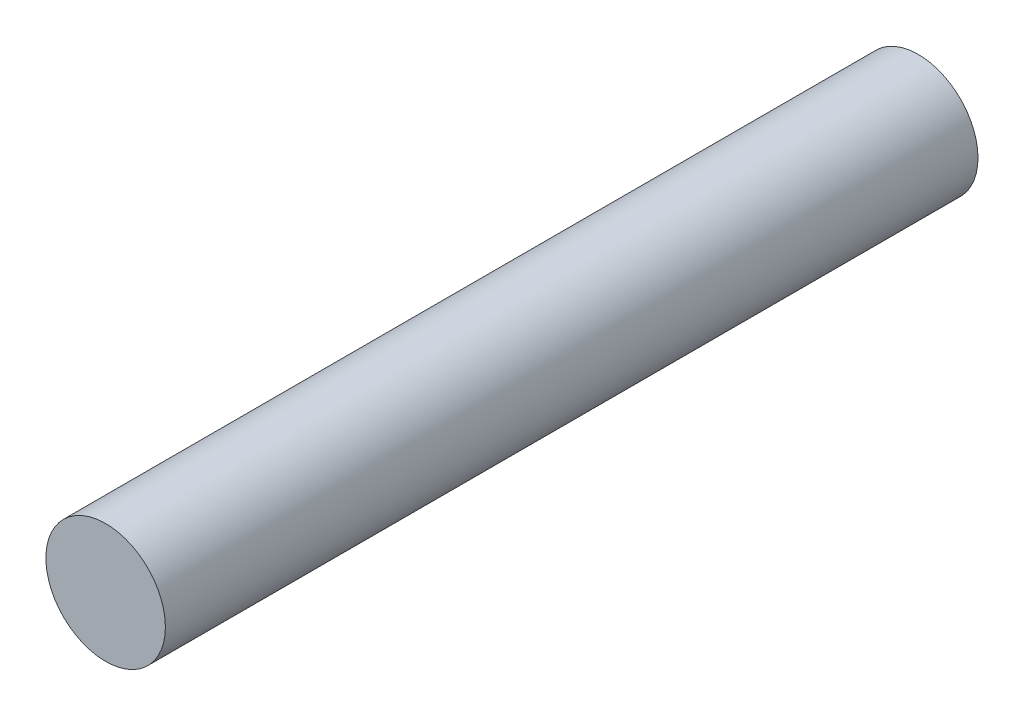
ISO-10303-21;
HEADER;
FILE_DESCRIPTION(('STEP AP214'),'2;1');
FILE_NAME('part.step','',(''),(''),'','','');
FILE_SCHEMA(('AUTOMOTIVE_DESIGN { 1 0 10303 214 1 1 1 1 }'));
ENDSEC;
DATA;
#1=APPLICATION_CONTEXT('core data for automotive mechanical design processes');
#2=APPLICATION_PROTOCOL_DEFINITION('international standard','automotive_design',2000,#1);
#3=PRODUCT_CONTEXT('',#1,'mechanical');
#4=PRODUCT('Part','Part','',(#3));
#5=PRODUCT_RELATED_PRODUCT_CATEGORY('part','',(#4));
#6=PRODUCT_DEFINITION_FORMATION('','',#4);
#7=PRODUCT_DEFINITION_CONTEXT('part definition',#1,'design');
#8=PRODUCT_DEFINITION('design','',#6,#7);
#9=PRODUCT_DEFINITION_SHAPE('','',#8);
#10=(LENGTH_UNIT() NAMED_UNIT(*) SI_UNIT(.MILLI.,.METRE.));
#11=(NAMED_UNIT(*) PLANE_ANGLE_UNIT() SI_UNIT($,.RADIAN.));
#12=(NAMED_UNIT(*) SI_UNIT($,.STERADIAN.) SOLID_ANGLE_UNIT());
#13=UNCERTAINTY_MEASURE_WITH_UNIT(LENGTH_MEASURE(1.E-05),#10,'distance_accuracy_value','');
#14=(GEOMETRIC_REPRESENTATION_CONTEXT(3) GLOBAL_UNCERTAINTY_ASSIGNED_CONTEXT((#13)) GLOBAL_UNIT_ASSIGNED_CONTEXT((#10,
#11,#12)) REPRESENTATION_CONTEXT('',''));
#15=CARTESIAN_POINT('',(0.,0.,0.));
#16=DIRECTION('',(0.,0.,1.));
#17=DIRECTION('',(1.,0.,0.));
#18=AXIS2_PLACEMENT_3D('',#15,#16,#17);
#19=CARTESIAN_POINT('',(0.,0.,34.));
#20=DIRECTION('',(0.,0.,-1.));
#21=DIRECTION('',(-1.,0.,0.));
#22=AXIS2_PLACEMENT_3D('',#19,#20,#21);
#23=CYLINDRICAL_SURFACE('',#22,2.5);
#24=CARTESIAN_POINT('',(0.,0.,34.));
#25=DIRECTION('',(0.,0.,1.));
#26=DIRECTION('',(1.,0.,0.));
#27=AXIS2_PLACEMENT_3D('',#24,#25,#26);
#28=CIRCLE('',#27,2.5);
#29=CARTESIAN_POINT('',(2.5,0.,34.));
#30=VERTEX_POINT('',#29);
#31=EDGE_CURVE('E10',#30,#30,#28,.T.);
#32=ORIENTED_EDGE('',*,*,#31,.F.);
#33=EDGE_LOOP('',(#32));
#34=FACE_BOUND('',#33,.T.);
#35=CARTESIAN_POINT('',(0.,0.,0.));
#36=DIRECTION('',(0.,0.,1.));
#37=DIRECTION('',(1.,0.,0.));
#38=AXIS2_PLACEMENT_3D('',#35,#36,#37);
#39=CIRCLE('',#38,2.5);
#40=CARTESIAN_POINT('',(2.5,0.,0.));
#41=VERTEX_POINT('',#40);
#42=EDGE_CURVE('E40',#41,#41,#39,.T.);
#43=ORIENTED_EDGE('',*,*,#42,.T.);
#44=EDGE_LOOP('',(#43));
#45=FACE_BOUND('',#44,.T.);
#46=ADVANCED_FACE('F37',(#34,#45),#23,.T.);
#47=CARTESIAN_POINT('',(0.,0.,34.));
#48=DIRECTION('',(0.,0.,1.));
#49=DIRECTION('',(1.,0.,0.));
#50=AXIS2_PLACEMENT_3D('',#47,#48,#49);
#51=PLANE('',#50);
#52=ORIENTED_EDGE('',*,*,#31,.T.);
#53=EDGE_LOOP('',(#52));
#54=FACE_BOUND('',#53,.T.);
#55=ADVANCED_FACE('F54',(#54),#51,.T.);
#56=CARTESIAN_POINT('',(0.,0.,0.));
#57=DIRECTION('',(0.,0.,1.));
#58=DIRECTION('',(1.,0.,0.));
#59=AXIS2_PLACEMENT_3D('',#56,#57,#58);
#60=PLANE('',#59);
#61=ORIENTED_EDGE('',*,*,#42,.F.);
#62=EDGE_LOOP('',(#61));
#63=FACE_BOUND('',#62,.T.);
#64=ADVANCED_FACE('F52',(#63),#60,.F.);
#65=CLOSED_SHELL('',(#46,#55,#64));
#66=MANIFOLD_SOLID_BREP('B2',#65);
#67=ADVANCED_BREP_SHAPE_REPRESENTATION('',(#18,#66),#14);
#68=SHAPE_DEFINITION_REPRESENTATION(#9,#67);
ENDSEC;
END-ISO-10303-21;
